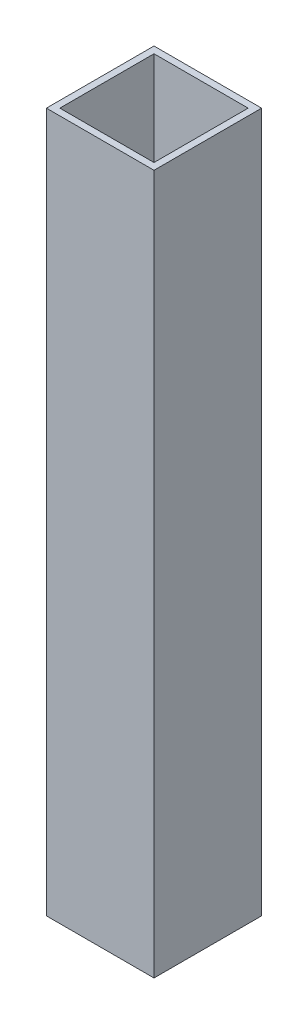
ISO-10303-21;
HEADER;
FILE_DESCRIPTION(('STEP AP214'),'2;1');
FILE_NAME('part.step','',(''),(''),'','','');
FILE_SCHEMA(('AUTOMOTIVE_DESIGN { 1 0 10303 214 1 1 1 1 }'));
ENDSEC;
DATA;
#1=APPLICATION_CONTEXT('core data for automotive mechanical design processes');
#2=APPLICATION_PROTOCOL_DEFINITION('international standard','automotive_design',2000,#1);
#3=PRODUCT_CONTEXT('',#1,'mechanical');
#4=PRODUCT('Part','Part','',(#3));
#5=PRODUCT_RELATED_PRODUCT_CATEGORY('part','',(#4));
#6=PRODUCT_DEFINITION_FORMATION('','',#4);
#7=PRODUCT_DEFINITION_CONTEXT('part definition',#1,'design');
#8=PRODUCT_DEFINITION('design','',#6,#7);
#9=PRODUCT_DEFINITION_SHAPE('','',#8);
#10=(LENGTH_UNIT() NAMED_UNIT(*) SI_UNIT(.MILLI.,.METRE.));
#11=(NAMED_UNIT(*) PLANE_ANGLE_UNIT() SI_UNIT($,.RADIAN.));
#12=(NAMED_UNIT(*) SI_UNIT($,.STERADIAN.) SOLID_ANGLE_UNIT());
#13=UNCERTAINTY_MEASURE_WITH_UNIT(LENGTH_MEASURE(1.E-05),#10,'distance_accuracy_value','');
#14=(GEOMETRIC_REPRESENTATION_CONTEXT(3) GLOBAL_UNCERTAINTY_ASSIGNED_CONTEXT((#13)) GLOBAL_UNIT_ASSIGNED_CONTEXT((#10,
#11,#12)) REPRESENTATION_CONTEXT('',''));
#15=CARTESIAN_POINT('',(0.,0.,0.));
#16=DIRECTION('',(0.,0.,1.));
#17=DIRECTION('',(1.,0.,0.));
#18=AXIS2_PLACEMENT_3D('',#15,#16,#17);
#19=CARTESIAN_POINT('',(0.,165.1,0.));
#20=DIRECTION('',(0.,1.,0.));
#21=DIRECTION('',(0.,0.,1.));
#22=AXIS2_PLACEMENT_3D('',#19,#20,#21);
#23=PLANE('',#22);
#24=DIRECTION('',(0.,0.,-1.));
#25=VECTOR('',#24,1.);
#26=CARTESIAN_POINT('',(12.7,165.1,12.7));
#27=LINE('',#26,#25);
#28=CARTESIAN_POINT('',(12.7,165.1,12.7));
#29=VERTEX_POINT('',#28);
#30=CARTESIAN_POINT('',(12.7,165.1,-12.7));
#31=VERTEX_POINT('',#30);
#32=EDGE_CURVE('E177',#29,#31,#27,.T.);
#33=ORIENTED_EDGE('',*,*,#32,.T.);
#34=DIRECTION('',(-1.,0.,0.));
#35=VECTOR('',#34,1.);
#36=CARTESIAN_POINT('',(-12.7,165.1,-12.7));
#37=LINE('',#36,#35);
#38=CARTESIAN_POINT('',(-12.7,165.1,-12.7));
#39=VERTEX_POINT('',#38);
#40=EDGE_CURVE('E181',#31,#39,#37,.T.);
#41=ORIENTED_EDGE('',*,*,#40,.T.);
#42=DIRECTION('',(0.,0.,1.));
#43=VECTOR('',#42,1.);
#44=CARTESIAN_POINT('',(-12.7,165.1,12.7));
#45=LINE('',#44,#43);
#46=CARTESIAN_POINT('',(-12.7,165.1,12.7));
#47=VERTEX_POINT('',#46);
#48=EDGE_CURVE('E185',#39,#47,#45,.T.);
#49=ORIENTED_EDGE('',*,*,#48,.T.);
#50=DIRECTION('',(1.,0.,0.));
#51=VECTOR('',#50,1.);
#52=CARTESIAN_POINT('',(-12.7,165.1,12.7));
#53=LINE('',#52,#51);
#54=EDGE_CURVE('E188',#47,#29,#53,.T.);
#55=ORIENTED_EDGE('',*,*,#54,.T.);
#56=EDGE_LOOP('',(#33,#41,#49,#55));
#57=FACE_BOUND('',#56,.T.);
#58=DIRECTION('',(-1.,0.,0.));
#59=VECTOR('',#58,1.);
#60=CARTESIAN_POINT('',(0.,165.1,-11.1125));
#61=LINE('',#60,#59);
#62=CARTESIAN_POINT('',(11.1125,165.1,-11.1125));
#63=VERTEX_POINT('',#62);
#64=CARTESIAN_POINT('',(-11.1125,165.1,-11.1125));
#65=VERTEX_POINT('',#64);
#66=EDGE_CURVE('E138',#63,#65,#61,.T.);
#67=ORIENTED_EDGE('',*,*,#66,.F.);
#68=DIRECTION('',(0.,0.,-1.));
#69=VECTOR('',#68,1.);
#70=CARTESIAN_POINT('',(11.1125,165.1,0.));
#71=LINE('',#70,#69);
#72=CARTESIAN_POINT('',(11.1125,165.1,11.1125));
#73=VERTEX_POINT('',#72);
#74=EDGE_CURVE('E129',#73,#63,#71,.T.);
#75=ORIENTED_EDGE('',*,*,#74,.F.);
#76=DIRECTION('',(1.,0.,0.));
#77=VECTOR('',#76,1.);
#78=CARTESIAN_POINT('',(0.,165.1,11.1125));
#79=LINE('',#78,#77);
#80=CARTESIAN_POINT('',(-11.1125,165.1,11.1125));
#81=VERTEX_POINT('',#80);
#82=EDGE_CURVE('E155',#81,#73,#79,.T.);
#83=ORIENTED_EDGE('',*,*,#82,.F.);
#84=DIRECTION('',(0.,0.,1.));
#85=VECTOR('',#84,1.);
#86=CARTESIAN_POINT('',(-11.1125,165.1,0.));
#87=LINE('',#86,#85);
#88=EDGE_CURVE('E151',#65,#81,#87,.T.);
#89=ORIENTED_EDGE('',*,*,#88,.F.);
#90=EDGE_LOOP('',(#67,#75,#83,#89));
#91=FACE_BOUND('',#90,.T.);
#92=ADVANCED_FACE('F63',(#57,#91),#23,.T.);
#93=CARTESIAN_POINT('',(0.,0.,0.));
#94=DIRECTION('',(0.,1.,0.));
#95=DIRECTION('',(0.,0.,1.));
#96=AXIS2_PLACEMENT_3D('',#93,#94,#95);
#97=PLANE('',#96);
#98=DIRECTION('',(0.,0.,-1.));
#99=VECTOR('',#98,1.);
#100=CARTESIAN_POINT('',(12.7,0.,12.7));
#101=LINE('',#100,#99);
#102=CARTESIAN_POINT('',(12.7,0.,12.7));
#103=VERTEX_POINT('',#102);
#104=CARTESIAN_POINT('',(12.7,0.,-12.7));
#105=VERTEX_POINT('',#104);
#106=EDGE_CURVE('E147',#103,#105,#101,.T.);
#107=ORIENTED_EDGE('',*,*,#106,.F.);
#108=DIRECTION('',(1.,0.,0.));
#109=VECTOR('',#108,1.);
#110=CARTESIAN_POINT('',(-12.7,0.,12.7));
#111=LINE('',#110,#109);
#112=CARTESIAN_POINT('',(-12.7,0.,12.7));
#113=VERTEX_POINT('',#112);
#114=EDGE_CURVE('E182',#113,#103,#111,.T.);
#115=ORIENTED_EDGE('',*,*,#114,.F.);
#116=DIRECTION('',(0.,0.,1.));
#117=VECTOR('',#116,1.);
#118=CARTESIAN_POINT('',(-12.7,0.,12.7));
#119=LINE('',#118,#117);
#120=CARTESIAN_POINT('',(-12.7,0.,-12.7));
#121=VERTEX_POINT('',#120);
#122=EDGE_CURVE('E198',#121,#113,#119,.T.);
#123=ORIENTED_EDGE('',*,*,#122,.F.);
#124=DIRECTION('',(-1.,0.,0.));
#125=VECTOR('',#124,1.);
#126=CARTESIAN_POINT('',(-12.7,0.,-12.7));
#127=LINE('',#126,#125);
#128=EDGE_CURVE('E195',#105,#121,#127,.T.);
#129=ORIENTED_EDGE('',*,*,#128,.F.);
#130=EDGE_LOOP('',(#107,#115,#123,#129));
#131=FACE_BOUND('',#130,.T.);
#132=DIRECTION('',(0.,0.,-1.));
#133=VECTOR('',#132,1.);
#134=CARTESIAN_POINT('',(11.1125,0.,0.));
#135=LINE('',#134,#133);
#136=CARTESIAN_POINT('',(11.1125,0.,11.1125));
#137=VERTEX_POINT('',#136);
#138=CARTESIAN_POINT('',(11.1125,0.,-11.1125));
#139=VERTEX_POINT('',#138);
#140=EDGE_CURVE('E87',#137,#139,#135,.T.);
#141=ORIENTED_EDGE('',*,*,#140,.T.);
#142=DIRECTION('',(-1.,0.,0.));
#143=VECTOR('',#142,1.);
#144=CARTESIAN_POINT('',(0.,0.,-11.1125));
#145=LINE('',#144,#143);
#146=CARTESIAN_POINT('',(-11.1125,0.,-11.1125));
#147=VERTEX_POINT('',#146);
#148=EDGE_CURVE('E145',#139,#147,#145,.T.);
#149=ORIENTED_EDGE('',*,*,#148,.T.);
#150=DIRECTION('',(0.,0.,1.));
#151=VECTOR('',#150,1.);
#152=CARTESIAN_POINT('',(-11.1125,0.,0.));
#153=LINE('',#152,#151);
#154=CARTESIAN_POINT('',(-11.1125,0.,11.1125));
#155=VERTEX_POINT('',#154);
#156=EDGE_CURVE('E164',#147,#155,#153,.T.);
#157=ORIENTED_EDGE('',*,*,#156,.T.);
#158=DIRECTION('',(1.,0.,0.));
#159=VECTOR('',#158,1.);
#160=CARTESIAN_POINT('',(0.,0.,11.1125));
#161=LINE('',#160,#159);
#162=EDGE_CURVE('E139',#155,#137,#161,.T.);
#163=ORIENTED_EDGE('',*,*,#162,.T.);
#164=EDGE_LOOP('',(#141,#149,#157,#163));
#165=FACE_BOUND('',#164,.T.);
#166=ADVANCED_FACE('F221',(#131,#165),#97,.F.);
#167=CARTESIAN_POINT('',(12.7,165.1,12.7));
#168=DIRECTION('',(-1.,0.,0.));
#169=DIRECTION('',(0.,0.,1.));
#170=AXIS2_PLACEMENT_3D('',#167,#168,#169);
#171=PLANE('',#170);
#172=ORIENTED_EDGE('',*,*,#106,.T.);
#173=DIRECTION('',(0.,-1.,0.));
#174=VECTOR('',#173,1.);
#175=CARTESIAN_POINT('',(12.7,165.1,-12.7));
#176=LINE('',#175,#174);
#177=EDGE_CURVE('E12',#31,#105,#176,.T.);
#178=ORIENTED_EDGE('',*,*,#177,.F.);
#179=ORIENTED_EDGE('',*,*,#32,.F.);
#180=DIRECTION('',(0.,-1.,0.));
#181=VECTOR('',#180,1.);
#182=CARTESIAN_POINT('',(12.7,165.1,12.7));
#183=LINE('',#182,#181);
#184=EDGE_CURVE('E191',#29,#103,#183,.T.);
#185=ORIENTED_EDGE('',*,*,#184,.T.);
#186=EDGE_LOOP('',(#172,#178,#179,#185));
#187=FACE_BOUND('',#186,.T.);
#188=ADVANCED_FACE('F65',(#187),#171,.F.);
#189=CARTESIAN_POINT('',(-12.7,165.1,-12.7));
#190=DIRECTION('',(0.,0.,1.));
#191=DIRECTION('',(1.,0.,0.));
#192=AXIS2_PLACEMENT_3D('',#189,#190,#191);
#193=PLANE('',#192);
#194=ORIENTED_EDGE('',*,*,#128,.T.);
#195=DIRECTION('',(0.,-1.,0.));
#196=VECTOR('',#195,1.);
#197=CARTESIAN_POINT('',(-12.7,165.1,-12.7));
#198=LINE('',#197,#196);
#199=EDGE_CURVE('E72',#39,#121,#198,.T.);
#200=ORIENTED_EDGE('',*,*,#199,.F.);
#201=ORIENTED_EDGE('',*,*,#40,.F.);
#202=ORIENTED_EDGE('',*,*,#177,.T.);
#203=EDGE_LOOP('',(#194,#200,#201,#202));
#204=FACE_BOUND('',#203,.T.);
#205=ADVANCED_FACE('F231',(#204),#193,.F.);
#206=CARTESIAN_POINT('',(-12.7,165.1,12.7));
#207=DIRECTION('',(1.,0.,0.));
#208=DIRECTION('',(0.,0.,-1.));
#209=AXIS2_PLACEMENT_3D('',#206,#207,#208);
#210=PLANE('',#209);
#211=ORIENTED_EDGE('',*,*,#122,.T.);
#212=DIRECTION('',(0.,-1.,0.));
#213=VECTOR('',#212,1.);
#214=CARTESIAN_POINT('',(-12.7,165.1,12.7));
#215=LINE('',#214,#213);
#216=EDGE_CURVE('E206',#47,#113,#215,.T.);
#217=ORIENTED_EDGE('',*,*,#216,.F.);
#218=ORIENTED_EDGE('',*,*,#48,.F.);
#219=ORIENTED_EDGE('',*,*,#199,.T.);
#220=EDGE_LOOP('',(#211,#217,#218,#219));
#221=FACE_BOUND('',#220,.T.);
#222=ADVANCED_FACE('F215',(#221),#210,.F.);
#223=CARTESIAN_POINT('',(-12.7,165.1,12.7));
#224=DIRECTION('',(0.,0.,-1.));
#225=DIRECTION('',(-1.,0.,0.));
#226=AXIS2_PLACEMENT_3D('',#223,#224,#225);
#227=PLANE('',#226);
#228=ORIENTED_EDGE('',*,*,#114,.T.);
#229=ORIENTED_EDGE('',*,*,#184,.F.);
#230=ORIENTED_EDGE('',*,*,#54,.F.);
#231=ORIENTED_EDGE('',*,*,#216,.T.);
#232=EDGE_LOOP('',(#228,#229,#230,#231));
#233=FACE_BOUND('',#232,.T.);
#234=ADVANCED_FACE('F225',(#233),#227,.F.);
#235=CARTESIAN_POINT('',(11.1125,165.1,0.));
#236=DIRECTION('',(-1.,0.,0.));
#237=DIRECTION('',(0.,0.,1.));
#238=AXIS2_PLACEMENT_3D('',#235,#236,#237);
#239=PLANE('',#238);
#240=ORIENTED_EDGE('',*,*,#140,.F.);
#241=DIRECTION('',(0.,-1.,0.));
#242=VECTOR('',#241,1.);
#243=CARTESIAN_POINT('',(11.1125,165.1,11.1125));
#244=LINE('',#243,#242);
#245=EDGE_CURVE('E133',#73,#137,#244,.T.);
#246=ORIENTED_EDGE('',*,*,#245,.F.);
#247=ORIENTED_EDGE('',*,*,#74,.T.);
#248=DIRECTION('',(0.,-1.,0.));
#249=VECTOR('',#248,1.);
#250=CARTESIAN_POINT('',(11.1125,165.1,-11.1125));
#251=LINE('',#250,#249);
#252=EDGE_CURVE('E132',#63,#139,#251,.T.);
#253=ORIENTED_EDGE('',*,*,#252,.T.);
#254=EDGE_LOOP('',(#240,#246,#247,#253));
#255=FACE_BOUND('',#254,.T.);
#256=ADVANCED_FACE('F131',(#255),#239,.T.);
#257=CARTESIAN_POINT('',(0.,165.1,-11.1125));
#258=DIRECTION('',(0.,0.,1.));
#259=DIRECTION('',(1.,0.,0.));
#260=AXIS2_PLACEMENT_3D('',#257,#258,#259);
#261=PLANE('',#260);
#262=ORIENTED_EDGE('',*,*,#148,.F.);
#263=ORIENTED_EDGE('',*,*,#252,.F.);
#264=ORIENTED_EDGE('',*,*,#66,.T.);
#265=DIRECTION('',(0.,-1.,0.));
#266=VECTOR('',#265,1.);
#267=CARTESIAN_POINT('',(-11.1125,165.1,-11.1125));
#268=LINE('',#267,#266);
#269=EDGE_CURVE('E148',#65,#147,#268,.T.);
#270=ORIENTED_EDGE('',*,*,#269,.T.);
#271=EDGE_LOOP('',(#262,#263,#264,#270));
#272=FACE_BOUND('',#271,.T.);
#273=ADVANCED_FACE('F142',(#272),#261,.T.);
#274=CARTESIAN_POINT('',(-11.1125,165.1,0.));
#275=DIRECTION('',(1.,0.,0.));
#276=DIRECTION('',(0.,0.,-1.));
#277=AXIS2_PLACEMENT_3D('',#274,#275,#276);
#278=PLANE('',#277);
#279=ORIENTED_EDGE('',*,*,#156,.F.);
#280=ORIENTED_EDGE('',*,*,#269,.F.);
#281=ORIENTED_EDGE('',*,*,#88,.T.);
#282=DIRECTION('',(0.,-1.,0.));
#283=VECTOR('',#282,1.);
#284=CARTESIAN_POINT('',(-11.1125,165.1,11.1125));
#285=LINE('',#284,#283);
#286=EDGE_CURVE('E79',#81,#155,#285,.T.);
#287=ORIENTED_EDGE('',*,*,#286,.T.);
#288=EDGE_LOOP('',(#279,#280,#281,#287));
#289=FACE_BOUND('',#288,.T.);
#290=ADVANCED_FACE('F254',(#289),#278,.T.);
#291=CARTESIAN_POINT('',(0.,165.1,11.1125));
#292=DIRECTION('',(0.,0.,-1.));
#293=DIRECTION('',(-1.,0.,0.));
#294=AXIS2_PLACEMENT_3D('',#291,#292,#293);
#295=PLANE('',#294);
#296=ORIENTED_EDGE('',*,*,#162,.F.);
#297=ORIENTED_EDGE('',*,*,#286,.F.);
#298=ORIENTED_EDGE('',*,*,#82,.T.);
#299=ORIENTED_EDGE('',*,*,#245,.T.);
#300=EDGE_LOOP('',(#296,#297,#298,#299));
#301=FACE_BOUND('',#300,.T.);
#302=ADVANCED_FACE('F258',(#301),#295,.T.);
#303=CLOSED_SHELL('',(#92,#166,#188,#205,#222,#234,#256,#273,#290,#302));
#304=MANIFOLD_SOLID_BREP('B2',#303);
#305=ADVANCED_BREP_SHAPE_REPRESENTATION('',(#18,#304),#14);
#306=SHAPE_DEFINITION_REPRESENTATION(#9,#305);
ENDSEC;
END-ISO-10303-21;
